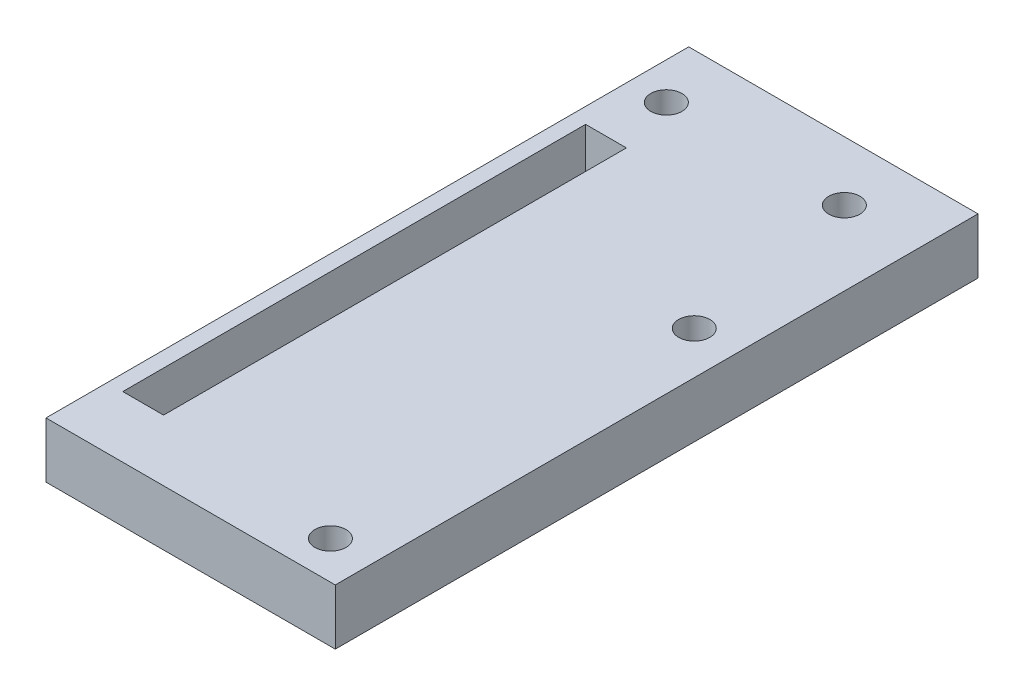
ISO-10303-21;
HEADER;
FILE_DESCRIPTION(('STEP AP214'),'2;1');
FILE_NAME('part.step','',(''),(''),'','','');
FILE_SCHEMA(('AUTOMOTIVE_DESIGN { 1 0 10303 214 1 1 1 1 }'));
ENDSEC;
DATA;
#1=APPLICATION_CONTEXT('core data for automotive mechanical design processes');
#2=APPLICATION_PROTOCOL_DEFINITION('international standard','automotive_design',2000,#1);
#3=PRODUCT_CONTEXT('',#1,'mechanical');
#4=PRODUCT('Part','Part','',(#3));
#5=PRODUCT_RELATED_PRODUCT_CATEGORY('part','',(#4));
#6=PRODUCT_DEFINITION_FORMATION('','',#4);
#7=PRODUCT_DEFINITION_CONTEXT('part definition',#1,'design');
#8=PRODUCT_DEFINITION('design','',#6,#7);
#9=PRODUCT_DEFINITION_SHAPE('','',#8);
#10=(LENGTH_UNIT() NAMED_UNIT(*) SI_UNIT(.MILLI.,.METRE.));
#11=(NAMED_UNIT(*) PLANE_ANGLE_UNIT() SI_UNIT($,.RADIAN.));
#12=(NAMED_UNIT(*) SI_UNIT($,.STERADIAN.) SOLID_ANGLE_UNIT());
#13=UNCERTAINTY_MEASURE_WITH_UNIT(LENGTH_MEASURE(1.E-05),#10,'distance_accuracy_value','');
#14=(GEOMETRIC_REPRESENTATION_CONTEXT(3) GLOBAL_UNCERTAINTY_ASSIGNED_CONTEXT((#13)) GLOBAL_UNIT_ASSIGNED_CONTEXT((#10,
#11,#12)) REPRESENTATION_CONTEXT('',''));
#15=CARTESIAN_POINT('',(0.,0.,0.));
#16=DIRECTION('',(0.,0.,1.));
#17=DIRECTION('',(1.,0.,0.));
#18=AXIS2_PLACEMENT_3D('',#15,#16,#17);
#19=CARTESIAN_POINT('',(0.,7.5,0.));
#20=DIRECTION('',(0.,-1.,0.));
#21=DIRECTION('',(0.,0.,-1.));
#22=AXIS2_PLACEMENT_3D('',#19,#20,#21);
#23=PLANE('',#22);
#24=DIRECTION('',(1.,0.,0.));
#25=VECTOR('',#24,1.);
#26=CARTESIAN_POINT('',(-10.9,7.5,-27.325));
#27=LINE('',#26,#25);
#28=CARTESIAN_POINT('',(-10.9,7.5,-27.325));
#29=VERTEX_POINT('',#28);
#30=CARTESIAN_POINT('',(-5.4,7.5,-27.325));
#31=VERTEX_POINT('',#30);
#32=EDGE_CURVE('E59',#29,#31,#27,.T.);
#33=ORIENTED_EDGE('',*,*,#32,.T.);
#34=DIRECTION('',(0.,0.,1.));
#35=VECTOR('',#34,1.);
#36=CARTESIAN_POINT('',(-5.4,7.5,-27.325));
#37=LINE('',#36,#35);
#38=CARTESIAN_POINT('',(-5.39999999999999,7.5,35.075));
#39=VERTEX_POINT('',#38);
#40=EDGE_CURVE('E138',#31,#39,#37,.T.);
#41=ORIENTED_EDGE('',*,*,#40,.T.);
#42=DIRECTION('',(-1.,0.,0.));
#43=VECTOR('',#42,1.);
#44=CARTESIAN_POINT('',(-5.39999999999999,7.5,35.075));
#45=LINE('',#44,#43);
#46=CARTESIAN_POINT('',(-10.9,7.5,35.075));
#47=VERTEX_POINT('',#46);
#48=EDGE_CURVE('E135',#39,#47,#45,.T.);
#49=ORIENTED_EDGE('',*,*,#48,.T.);
#50=DIRECTION('',(0.,0.,-1.));
#51=VECTOR('',#50,1.);
#52=CARTESIAN_POINT('',(-10.9,7.5,35.075));
#53=LINE('',#52,#51);
#54=EDGE_CURVE('E131',#47,#29,#53,.T.);
#55=ORIENTED_EDGE('',*,*,#54,.T.);
#56=EDGE_LOOP('',(#33,#41,#49,#55));
#57=FACE_BOUND('',#56,.T.);
#58=CARTESIAN_POINT('',(-8.018,7.5,-35.325));
#59=DIRECTION('',(0.,1.,0.));
#60=DIRECTION('',(0.,0.,1.));
#61=AXIS2_PLACEMENT_3D('',#58,#59,#60);
#62=CIRCLE('',#61,2.1);
#63=CARTESIAN_POINT('',(-8.018,7.5,-33.225));
#64=VERTEX_POINT('',#63);
#65=EDGE_CURVE('E150',#64,#64,#62,.T.);
#66=ORIENTED_EDGE('',*,*,#65,.F.);
#67=EDGE_LOOP('',(#66));
#68=FACE_BOUND('',#67,.T.);
#69=CARTESIAN_POINT('',(15.982,7.5,-35.325));
#70=DIRECTION('',(0.,1.,0.));
#71=DIRECTION('',(0.,0.,1.));
#72=AXIS2_PLACEMENT_3D('',#69,#70,#71);
#73=CIRCLE('',#72,2.1);
#74=CARTESIAN_POINT('',(15.982,7.5,-33.225));
#75=VERTEX_POINT('',#74);
#76=EDGE_CURVE('E157',#75,#75,#73,.T.);
#77=ORIENTED_EDGE('',*,*,#76,.F.);
#78=EDGE_LOOP('',(#77));
#79=FACE_BOUND('',#78,.T.);
#80=CARTESIAN_POINT('',(20.25,7.5,38.229));
#81=DIRECTION('',(0.,1.,0.));
#82=DIRECTION('',(0.,0.,1.));
#83=AXIS2_PLACEMENT_3D('',#80,#81,#82);
#84=CIRCLE('',#83,2.1);
#85=CARTESIAN_POINT('',(20.25,7.5,40.329));
#86=VERTEX_POINT('',#85);
#87=EDGE_CURVE('E162',#86,#86,#84,.T.);
#88=ORIENTED_EDGE('',*,*,#87,.F.);
#89=EDGE_LOOP('',(#88));
#90=FACE_BOUND('',#89,.T.);
#91=CARTESIAN_POINT('',(20.25,7.5,-10.821));
#92=DIRECTION('',(0.,1.,0.));
#93=DIRECTION('',(0.,0.,1.));
#94=AXIS2_PLACEMENT_3D('',#91,#92,#93);
#95=CIRCLE('',#94,2.1);
#96=CARTESIAN_POINT('',(20.25,7.5,-8.721));
#97=VERTEX_POINT('',#96);
#98=EDGE_CURVE('E169',#97,#97,#95,.T.);
#99=ORIENTED_EDGE('',*,*,#98,.F.);
#100=EDGE_LOOP('',(#99));
#101=FACE_BOUND('',#100,.T.);
#102=DIRECTION('',(0.,0.,-1.));
#103=VECTOR('',#102,1.);
#104=CARTESIAN_POINT('',(-13.,7.5,-43.325));
#105=LINE('',#104,#103);
#106=CARTESIAN_POINT('',(-13.,7.5,43.325));
#107=VERTEX_POINT('',#106);
#108=CARTESIAN_POINT('',(-13.,7.5,-43.325));
#109=VERTEX_POINT('',#108);
#110=EDGE_CURVE('E114',#107,#109,#105,.T.);
#111=ORIENTED_EDGE('',*,*,#110,.F.);
#112=DIRECTION('',(1.,0.,0.));
#113=VECTOR('',#112,1.);
#114=CARTESIAN_POINT('',(25.,7.5,43.325));
#115=LINE('',#114,#113);
#116=CARTESIAN_POINT('',(26.,7.5,43.325));
#117=VERTEX_POINT('',#116);
#118=EDGE_CURVE('E43',#107,#117,#115,.T.);
#119=ORIENTED_EDGE('',*,*,#118,.T.);
#120=DIRECTION('',(0.,0.,1.));
#121=VECTOR('',#120,1.);
#122=CARTESIAN_POINT('',(26.,7.5,43.325));
#123=LINE('',#122,#121);
#124=CARTESIAN_POINT('',(26.,7.5,-43.325));
#125=VERTEX_POINT('',#124);
#126=EDGE_CURVE('E166',#125,#117,#123,.T.);
#127=ORIENTED_EDGE('',*,*,#126,.F.);
#128=DIRECTION('',(-1.,0.,0.));
#129=VECTOR('',#128,1.);
#130=CARTESIAN_POINT('',(25.,7.5,-43.325));
#131=LINE('',#130,#129);
#132=EDGE_CURVE('E11',#125,#109,#131,.T.);
#133=ORIENTED_EDGE('',*,*,#132,.T.);
#134=EDGE_LOOP('',(#111,#119,#127,#133));
#135=FACE_BOUND('',#134,.T.);
#136=ADVANCED_FACE('F34',(#57,#68,#79,#90,#101,#135),#23,.F.);
#137=CARTESIAN_POINT('',(25.,7.5,43.325));
#138=DIRECTION('',(0.,0.,-1.));
#139=DIRECTION('',(-1.,0.,0.));
#140=AXIS2_PLACEMENT_3D('',#137,#138,#139);
#141=PLANE('',#140);
#142=DIRECTION('',(0.,1.,0.));
#143=VECTOR('',#142,1.);
#144=CARTESIAN_POINT('',(-13.,7.5,43.325));
#145=LINE('',#144,#143);
#146=CARTESIAN_POINT('',(-13.,0.,43.325));
#147=VERTEX_POINT('',#146);
#148=EDGE_CURVE('E103',#147,#107,#145,.T.);
#149=ORIENTED_EDGE('',*,*,#148,.F.);
#150=DIRECTION('',(1.,0.,0.));
#151=VECTOR('',#150,1.);
#152=CARTESIAN_POINT('',(25.,0.,43.325));
#153=LINE('',#152,#151);
#154=CARTESIAN_POINT('',(26.,0.,43.325));
#155=VERTEX_POINT('',#154);
#156=EDGE_CURVE('E112',#147,#155,#153,.T.);
#157=ORIENTED_EDGE('',*,*,#156,.T.);
#158=DIRECTION('',(0.,-1.,0.));
#159=VECTOR('',#158,1.);
#160=CARTESIAN_POINT('',(26.,7.5,43.325));
#161=LINE('',#160,#159);
#162=EDGE_CURVE('E180',#117,#155,#161,.T.);
#163=ORIENTED_EDGE('',*,*,#162,.F.);
#164=ORIENTED_EDGE('',*,*,#118,.F.);
#165=EDGE_LOOP('',(#149,#157,#163,#164));
#166=FACE_BOUND('',#165,.T.);
#167=ADVANCED_FACE('F36',(#166),#141,.F.);
#168=CARTESIAN_POINT('',(25.,7.5,-43.325));
#169=DIRECTION('',(0.,0.,1.));
#170=DIRECTION('',(1.,0.,0.));
#171=AXIS2_PLACEMENT_3D('',#168,#169,#170);
#172=PLANE('',#171);
#173=DIRECTION('',(0.,-1.,0.));
#174=VECTOR('',#173,1.);
#175=CARTESIAN_POINT('',(-13.,7.5,-43.325));
#176=LINE('',#175,#174);
#177=CARTESIAN_POINT('',(-13.,0.,-43.325));
#178=VERTEX_POINT('',#177);
#179=EDGE_CURVE('E51',#109,#178,#176,.T.);
#180=ORIENTED_EDGE('',*,*,#179,.F.);
#181=ORIENTED_EDGE('',*,*,#132,.F.);
#182=DIRECTION('',(0.,1.,0.));
#183=VECTOR('',#182,1.);
#184=CARTESIAN_POINT('',(26.,7.5,-43.325));
#185=LINE('',#184,#183);
#186=CARTESIAN_POINT('',(26.,0.,-43.325));
#187=VERTEX_POINT('',#186);
#188=EDGE_CURVE('E176',#187,#125,#185,.T.);
#189=ORIENTED_EDGE('',*,*,#188,.F.);
#190=DIRECTION('',(-1.,0.,0.));
#191=VECTOR('',#190,1.);
#192=CARTESIAN_POINT('',(25.,0.,-43.325));
#193=LINE('',#192,#191);
#194=EDGE_CURVE('E38',#187,#178,#193,.T.);
#195=ORIENTED_EDGE('',*,*,#194,.T.);
#196=EDGE_LOOP('',(#180,#181,#189,#195));
#197=FACE_BOUND('',#196,.T.);
#198=ADVANCED_FACE('F185',(#197),#172,.F.);
#199=CARTESIAN_POINT('',(0.,0.,0.));
#200=DIRECTION('',(0.,-1.,0.));
#201=DIRECTION('',(0.,0.,-1.));
#202=AXIS2_PLACEMENT_3D('',#199,#200,#201);
#203=PLANE('',#202);
#204=CARTESIAN_POINT('',(20.25,0.,-10.821));
#205=DIRECTION('',(0.,1.,0.));
#206=DIRECTION('',(0.,0.,1.));
#207=AXIS2_PLACEMENT_3D('',#204,#205,#206);
#208=CIRCLE('',#207,2.1);
#209=CARTESIAN_POINT('',(20.25,0.,-8.721));
#210=VERTEX_POINT('',#209);
#211=EDGE_CURVE('E154',#210,#210,#208,.T.);
#212=ORIENTED_EDGE('',*,*,#211,.T.);
#213=EDGE_LOOP('',(#212));
#214=FACE_BOUND('',#213,.T.);
#215=CARTESIAN_POINT('',(20.25,0.,38.229));
#216=DIRECTION('',(0.,1.,0.));
#217=DIRECTION('',(0.,0.,1.));
#218=AXIS2_PLACEMENT_3D('',#215,#216,#217);
#219=CIRCLE('',#218,2.1);
#220=CARTESIAN_POINT('',(20.25,0.,40.329));
#221=VERTEX_POINT('',#220);
#222=EDGE_CURVE('E165',#221,#221,#219,.T.);
#223=ORIENTED_EDGE('',*,*,#222,.T.);
#224=EDGE_LOOP('',(#223));
#225=FACE_BOUND('',#224,.T.);
#226=CARTESIAN_POINT('',(15.982,0.,-35.325));
#227=DIRECTION('',(0.,1.,0.));
#228=DIRECTION('',(0.,0.,1.));
#229=AXIS2_PLACEMENT_3D('',#226,#227,#228);
#230=CIRCLE('',#229,2.1);
#231=CARTESIAN_POINT('',(15.982,0.,-33.225));
#232=VERTEX_POINT('',#231);
#233=EDGE_CURVE('E142',#232,#232,#230,.T.);
#234=ORIENTED_EDGE('',*,*,#233,.T.);
#235=EDGE_LOOP('',(#234));
#236=FACE_BOUND('',#235,.T.);
#237=CARTESIAN_POINT('',(-8.018,0.,-35.325));
#238=DIRECTION('',(0.,1.,0.));
#239=DIRECTION('',(0.,0.,1.));
#240=AXIS2_PLACEMENT_3D('',#237,#238,#239);
#241=CIRCLE('',#240,2.1);
#242=CARTESIAN_POINT('',(-8.018,0.,-33.225));
#243=VERTEX_POINT('',#242);
#244=EDGE_CURVE('E153',#243,#243,#241,.T.);
#245=ORIENTED_EDGE('',*,*,#244,.T.);
#246=EDGE_LOOP('',(#245));
#247=FACE_BOUND('',#246,.T.);
#248=ORIENTED_EDGE('',*,*,#156,.F.);
#249=DIRECTION('',(0.,0.,1.));
#250=VECTOR('',#249,1.);
#251=CARTESIAN_POINT('',(-13.,0.,-43.325));
#252=LINE('',#251,#250);
#253=EDGE_CURVE('E100',#178,#147,#252,.T.);
#254=ORIENTED_EDGE('',*,*,#253,.F.);
#255=ORIENTED_EDGE('',*,*,#194,.F.);
#256=DIRECTION('',(0.,0.,-1.));
#257=VECTOR('',#256,1.);
#258=CARTESIAN_POINT('',(26.,0.,43.325));
#259=LINE('',#258,#257);
#260=EDGE_CURVE('E118',#155,#187,#259,.T.);
#261=ORIENTED_EDGE('',*,*,#260,.F.);
#262=EDGE_LOOP('',(#248,#254,#255,#261));
#263=FACE_BOUND('',#262,.T.);
#264=ADVANCED_FACE('F116',(#214,#225,#236,#247,#263),#203,.T.);
#265=CARTESIAN_POINT('',(-10.9,1.55,-27.325));
#266=DIRECTION('',(0.,0.,1.));
#267=DIRECTION('',(1.,0.,0.));
#268=AXIS2_PLACEMENT_3D('',#265,#266,#267);
#269=PLANE('',#268);
#270=ORIENTED_EDGE('',*,*,#32,.F.);
#271=DIRECTION('',(0.,1.,0.));
#272=VECTOR('',#271,1.);
#273=CARTESIAN_POINT('',(-10.9,1.55,-27.325));
#274=LINE('',#273,#272);
#275=CARTESIAN_POINT('',(-10.9,1.55,-27.325));
#276=VERTEX_POINT('',#275);
#277=EDGE_CURVE('E128',#276,#29,#274,.T.);
#278=ORIENTED_EDGE('',*,*,#277,.F.);
#279=DIRECTION('',(1.,0.,0.));
#280=VECTOR('',#279,1.);
#281=CARTESIAN_POINT('',(-10.9,1.55,-27.325));
#282=LINE('',#281,#280);
#283=CARTESIAN_POINT('',(-5.4,1.55,-27.325));
#284=VERTEX_POINT('',#283);
#285=EDGE_CURVE('E134',#276,#284,#282,.T.);
#286=ORIENTED_EDGE('',*,*,#285,.T.);
#287=DIRECTION('',(0.,1.,0.));
#288=VECTOR('',#287,1.);
#289=CARTESIAN_POINT('',(-5.4,1.55,-27.325));
#290=LINE('',#289,#288);
#291=EDGE_CURVE('E120',#284,#31,#290,.T.);
#292=ORIENTED_EDGE('',*,*,#291,.T.);
#293=EDGE_LOOP('',(#270,#278,#286,#292));
#294=FACE_BOUND('',#293,.T.);
#295=ADVANCED_FACE('F210',(#294),#269,.T.);
#296=CARTESIAN_POINT('',(-5.4,1.55,-27.325));
#297=DIRECTION('',(-1.,0.,0.));
#298=DIRECTION('',(0.,0.,1.));
#299=AXIS2_PLACEMENT_3D('',#296,#297,#298);
#300=PLANE('',#299);
#301=ORIENTED_EDGE('',*,*,#40,.F.);
#302=ORIENTED_EDGE('',*,*,#291,.F.);
#303=DIRECTION('',(0.,0.,1.));
#304=VECTOR('',#303,1.);
#305=CARTESIAN_POINT('',(-5.4,1.55,-27.325));
#306=LINE('',#305,#304);
#307=CARTESIAN_POINT('',(-5.39999999999999,1.55,35.075));
#308=VERTEX_POINT('',#307);
#309=EDGE_CURVE('E146',#284,#308,#306,.T.);
#310=ORIENTED_EDGE('',*,*,#309,.T.);
#311=DIRECTION('',(0.,1.,0.));
#312=VECTOR('',#311,1.);
#313=CARTESIAN_POINT('',(-5.39999999999999,1.55,35.075));
#314=LINE('',#313,#312);
#315=EDGE_CURVE('E121',#308,#39,#314,.T.);
#316=ORIENTED_EDGE('',*,*,#315,.T.);
#317=EDGE_LOOP('',(#301,#302,#310,#316));
#318=FACE_BOUND('',#317,.T.);
#319=ADVANCED_FACE('F230',(#318),#300,.T.);
#320=CARTESIAN_POINT('',(-5.39999999999999,1.55,35.075));
#321=DIRECTION('',(0.,0.,-1.));
#322=DIRECTION('',(-1.,0.,0.));
#323=AXIS2_PLACEMENT_3D('',#320,#321,#322);
#324=PLANE('',#323);
#325=ORIENTED_EDGE('',*,*,#48,.F.);
#326=ORIENTED_EDGE('',*,*,#315,.F.);
#327=DIRECTION('',(-1.,0.,0.));
#328=VECTOR('',#327,1.);
#329=CARTESIAN_POINT('',(-5.39999999999999,1.55,35.075));
#330=LINE('',#329,#328);
#331=CARTESIAN_POINT('',(-10.9,1.55,35.075));
#332=VERTEX_POINT('',#331);
#333=EDGE_CURVE('E144',#308,#332,#330,.T.);
#334=ORIENTED_EDGE('',*,*,#333,.T.);
#335=DIRECTION('',(0.,1.,0.));
#336=VECTOR('',#335,1.);
#337=CARTESIAN_POINT('',(-10.9,1.55,35.075));
#338=LINE('',#337,#336);
#339=EDGE_CURVE('E126',#332,#47,#338,.T.);
#340=ORIENTED_EDGE('',*,*,#339,.T.);
#341=EDGE_LOOP('',(#325,#326,#334,#340));
#342=FACE_BOUND('',#341,.T.);
#343=ADVANCED_FACE('F236',(#342),#324,.T.);
#344=CARTESIAN_POINT('',(-10.9,1.55,35.075));
#345=DIRECTION('',(1.,0.,0.));
#346=DIRECTION('',(0.,0.,-1.));
#347=AXIS2_PLACEMENT_3D('',#344,#345,#346);
#348=PLANE('',#347);
#349=ORIENTED_EDGE('',*,*,#54,.F.);
#350=ORIENTED_EDGE('',*,*,#339,.F.);
#351=DIRECTION('',(0.,0.,-1.));
#352=VECTOR('',#351,1.);
#353=CARTESIAN_POINT('',(-10.9,1.55,35.075));
#354=LINE('',#353,#352);
#355=EDGE_CURVE('E130',#332,#276,#354,.T.);
#356=ORIENTED_EDGE('',*,*,#355,.T.);
#357=ORIENTED_EDGE('',*,*,#277,.T.);
#358=EDGE_LOOP('',(#349,#350,#356,#357));
#359=FACE_BOUND('',#358,.T.);
#360=ADVANCED_FACE('F243',(#359),#348,.T.);
#361=CARTESIAN_POINT('',(0.,1.55,0.));
#362=DIRECTION('',(0.,-1.,0.));
#363=DIRECTION('',(0.,0.,-1.));
#364=AXIS2_PLACEMENT_3D('',#361,#362,#363);
#365=PLANE('',#364);
#366=ORIENTED_EDGE('',*,*,#285,.F.);
#367=ORIENTED_EDGE('',*,*,#355,.F.);
#368=ORIENTED_EDGE('',*,*,#333,.F.);
#369=ORIENTED_EDGE('',*,*,#309,.F.);
#370=EDGE_LOOP('',(#366,#367,#368,#369));
#371=FACE_BOUND('',#370,.T.);
#372=ADVANCED_FACE('F251',(#371),#365,.F.);
#373=CARTESIAN_POINT('',(-8.018,0.,-35.325));
#374=DIRECTION('',(0.,1.,0.));
#375=DIRECTION('',(0.,0.,1.));
#376=AXIS2_PLACEMENT_3D('',#373,#374,#375);
#377=CYLINDRICAL_SURFACE('',#376,2.1);
#378=ORIENTED_EDGE('',*,*,#244,.F.);
#379=EDGE_LOOP('',(#378));
#380=FACE_BOUND('',#379,.T.);
#381=ORIENTED_EDGE('',*,*,#65,.T.);
#382=EDGE_LOOP('',(#381));
#383=FACE_BOUND('',#382,.T.);
#384=ADVANCED_FACE('F259',(#380,#383),#377,.F.);
#385=CARTESIAN_POINT('',(15.982,0.,-35.325));
#386=DIRECTION('',(0.,1.,0.));
#387=DIRECTION('',(0.,0.,1.));
#388=AXIS2_PLACEMENT_3D('',#385,#386,#387);
#389=CYLINDRICAL_SURFACE('',#388,2.1);
#390=ORIENTED_EDGE('',*,*,#233,.F.);
#391=EDGE_LOOP('',(#390));
#392=FACE_BOUND('',#391,.T.);
#393=ORIENTED_EDGE('',*,*,#76,.T.);
#394=EDGE_LOOP('',(#393));
#395=FACE_BOUND('',#394,.T.);
#396=ADVANCED_FACE('F267',(#392,#395),#389,.F.);
#397=CARTESIAN_POINT('',(20.25,0.,38.229));
#398=DIRECTION('',(0.,1.,0.));
#399=DIRECTION('',(0.,0.,1.));
#400=AXIS2_PLACEMENT_3D('',#397,#398,#399);
#401=CYLINDRICAL_SURFACE('',#400,2.1);
#402=ORIENTED_EDGE('',*,*,#222,.F.);
#403=EDGE_LOOP('',(#402));
#404=FACE_BOUND('',#403,.T.);
#405=ORIENTED_EDGE('',*,*,#87,.T.);
#406=EDGE_LOOP('',(#405));
#407=FACE_BOUND('',#406,.T.);
#408=ADVANCED_FACE('F198',(#404,#407),#401,.F.);
#409=CARTESIAN_POINT('',(20.25,0.,-10.821));
#410=DIRECTION('',(0.,1.,0.));
#411=DIRECTION('',(0.,0.,1.));
#412=AXIS2_PLACEMENT_3D('',#409,#410,#411);
#413=CYLINDRICAL_SURFACE('',#412,2.1);
#414=ORIENTED_EDGE('',*,*,#211,.F.);
#415=EDGE_LOOP('',(#414));
#416=FACE_BOUND('',#415,.T.);
#417=ORIENTED_EDGE('',*,*,#98,.T.);
#418=EDGE_LOOP('',(#417));
#419=FACE_BOUND('',#418,.T.);
#420=ADVANCED_FACE('F191',(#416,#419),#413,.F.);
#421=CARTESIAN_POINT('',(26.,0.,0.));
#422=DIRECTION('',(1.,0.,0.));
#423=DIRECTION('',(0.,0.,-1.));
#424=AXIS2_PLACEMENT_3D('',#421,#422,#423);
#425=PLANE('',#424);
#426=ORIENTED_EDGE('',*,*,#162,.T.);
#427=ORIENTED_EDGE('',*,*,#260,.T.);
#428=ORIENTED_EDGE('',*,*,#188,.T.);
#429=ORIENTED_EDGE('',*,*,#126,.T.);
#430=EDGE_LOOP('',(#426,#427,#428,#429));
#431=FACE_BOUND('',#430,.T.);
#432=ADVANCED_FACE('F189',(#431),#425,.T.);
#433=CARTESIAN_POINT('',(-13.,0.,0.));
#434=DIRECTION('',(-1.,0.,0.));
#435=DIRECTION('',(0.,0.,1.));
#436=AXIS2_PLACEMENT_3D('',#433,#434,#435);
#437=PLANE('',#436);
#438=ORIENTED_EDGE('',*,*,#179,.T.);
#439=ORIENTED_EDGE('',*,*,#253,.T.);
#440=ORIENTED_EDGE('',*,*,#148,.T.);
#441=ORIENTED_EDGE('',*,*,#110,.T.);
#442=EDGE_LOOP('',(#438,#439,#440,#441));
#443=FACE_BOUND('',#442,.T.);
#444=ADVANCED_FACE('F102',(#443),#437,.T.);
#445=CLOSED_SHELL('',(#136,#167,#198,#264,#295,#319,#343,#360,#372,#384,#396,#408,#420,#432,#444));
#446=MANIFOLD_SOLID_BREP('B2',#445);
#447=ADVANCED_BREP_SHAPE_REPRESENTATION('',(#18,#446),#14);
#448=SHAPE_DEFINITION_REPRESENTATION(#9,#447);
ENDSEC;
END-ISO-10303-21;
